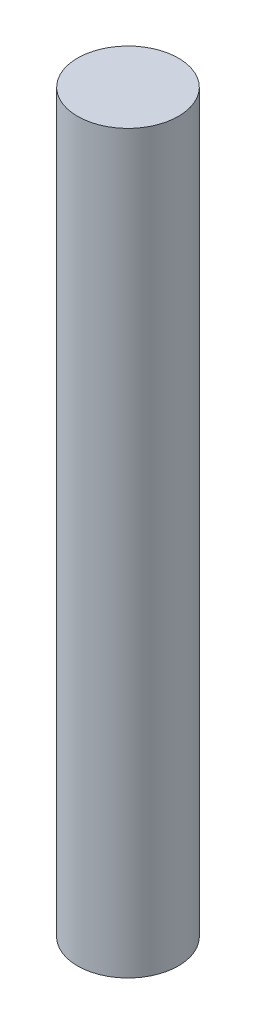
ISO-10303-21;
HEADER;
FILE_DESCRIPTION(('STEP AP214'),'2;1');
FILE_NAME('part.step','',(''),(''),'','','');
FILE_SCHEMA(('AUTOMOTIVE_DESIGN { 1 0 10303 214 1 1 1 1 }'));
ENDSEC;
DATA;
#1=APPLICATION_CONTEXT('core data for automotive mechanical design processes');
#2=APPLICATION_PROTOCOL_DEFINITION('international standard','automotive_design',2000,#1);
#3=PRODUCT_CONTEXT('',#1,'mechanical');
#4=PRODUCT('Part','Part','',(#3));
#5=PRODUCT_RELATED_PRODUCT_CATEGORY('part','',(#4));
#6=PRODUCT_DEFINITION_FORMATION('','',#4);
#7=PRODUCT_DEFINITION_CONTEXT('part definition',#1,'design');
#8=PRODUCT_DEFINITION('design','',#6,#7);
#9=PRODUCT_DEFINITION_SHAPE('','',#8);
#10=(LENGTH_UNIT() NAMED_UNIT(*) SI_UNIT(.MILLI.,.METRE.));
#11=(NAMED_UNIT(*) PLANE_ANGLE_UNIT() SI_UNIT($,.RADIAN.));
#12=(NAMED_UNIT(*) SI_UNIT($,.STERADIAN.) SOLID_ANGLE_UNIT());
#13=UNCERTAINTY_MEASURE_WITH_UNIT(LENGTH_MEASURE(1.E-05),#10,'distance_accuracy_value','');
#14=(GEOMETRIC_REPRESENTATION_CONTEXT(3) GLOBAL_UNCERTAINTY_ASSIGNED_CONTEXT((#13)) GLOBAL_UNIT_ASSIGNED_CONTEXT((#10,
#11,#12)) REPRESENTATION_CONTEXT('',''));
#15=CARTESIAN_POINT('',(0.,0.,0.));
#16=DIRECTION('',(0.,0.,1.));
#17=DIRECTION('',(1.,0.,0.));
#18=AXIS2_PLACEMENT_3D('',#15,#16,#17);
#19=CARTESIAN_POINT('',(0.,35.,0.));
#20=DIRECTION('',(0.,-1.,0.));
#21=DIRECTION('',(0.,0.,-1.));
#22=AXIS2_PLACEMENT_3D('',#19,#20,#21);
#23=CYLINDRICAL_SURFACE('',#22,2.4);
#24=CARTESIAN_POINT('',(0.,35.,0.));
#25=DIRECTION('',(0.,1.,0.));
#26=DIRECTION('',(0.,0.,1.));
#27=AXIS2_PLACEMENT_3D('',#24,#25,#26);
#28=CIRCLE('',#27,2.4);
#29=CARTESIAN_POINT('',(0.,35.,2.4));
#30=VERTEX_POINT('',#29);
#31=EDGE_CURVE('E10',#30,#30,#28,.T.);
#32=ORIENTED_EDGE('',*,*,#31,.F.);
#33=EDGE_LOOP('',(#32));
#34=FACE_BOUND('',#33,.T.);
#35=CARTESIAN_POINT('',(0.,0.,0.));
#36=DIRECTION('',(0.,1.,0.));
#37=DIRECTION('',(0.,0.,1.));
#38=AXIS2_PLACEMENT_3D('',#35,#36,#37);
#39=CIRCLE('',#38,2.4);
#40=CARTESIAN_POINT('',(0.,0.,2.4));
#41=VERTEX_POINT('',#40);
#42=EDGE_CURVE('E44',#41,#41,#39,.T.);
#43=ORIENTED_EDGE('',*,*,#42,.T.);
#44=EDGE_LOOP('',(#43));
#45=FACE_BOUND('',#44,.T.);
#46=ADVANCED_FACE('F41',(#34,#45),#23,.T.);
#47=CARTESIAN_POINT('',(0.,35.,0.));
#48=DIRECTION('',(0.,1.,0.));
#49=DIRECTION('',(0.,0.,1.));
#50=AXIS2_PLACEMENT_3D('',#47,#48,#49);
#51=PLANE('',#50);
#52=ORIENTED_EDGE('',*,*,#31,.T.);
#53=EDGE_LOOP('',(#52));
#54=FACE_BOUND('',#53,.T.);
#55=ADVANCED_FACE('F58',(#54),#51,.T.);
#56=CARTESIAN_POINT('',(0.,0.,0.));
#57=DIRECTION('',(0.,1.,0.));
#58=DIRECTION('',(0.,0.,1.));
#59=AXIS2_PLACEMENT_3D('',#56,#57,#58);
#60=PLANE('',#59);
#61=ORIENTED_EDGE('',*,*,#42,.F.);
#62=EDGE_LOOP('',(#61));
#63=FACE_BOUND('',#62,.T.);
#64=ADVANCED_FACE('F56',(#63),#60,.F.);
#65=CLOSED_SHELL('',(#46,#55,#64));
#66=MANIFOLD_SOLID_BREP('B2',#65);
#67=ADVANCED_BREP_SHAPE_REPRESENTATION('',(#18,#66),#14);
#68=SHAPE_DEFINITION_REPRESENTATION(#9,#67);
ENDSEC;
END-ISO-10303-21;
